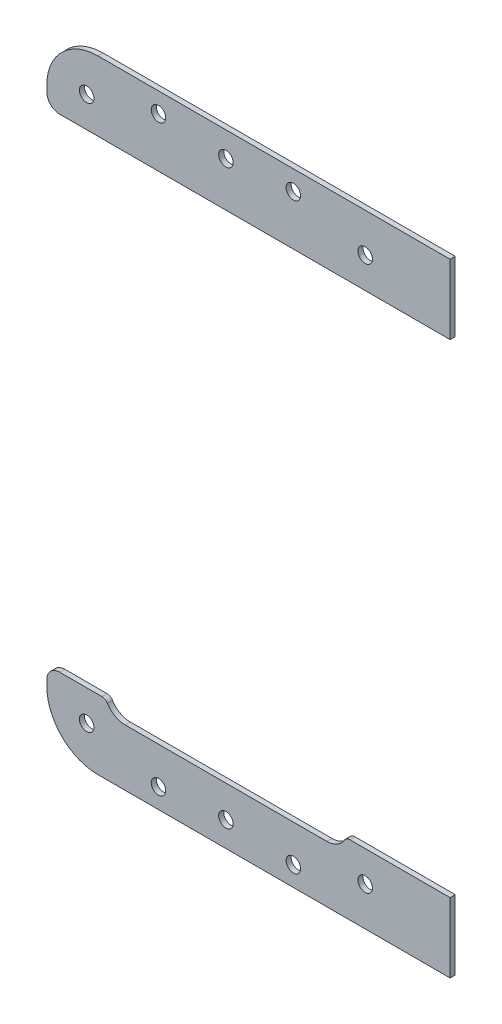
ISO-10303-21;
HEADER;
FILE_DESCRIPTION(('STEP AP214'),'2;1');
FILE_NAME('part.step','',(''),(''),'','','');
FILE_SCHEMA(('AUTOMOTIVE_DESIGN { 1 0 10303 214 1 1 1 1 }'));
ENDSEC;
DATA;
#1=APPLICATION_CONTEXT('core data for automotive mechanical design processes');
#2=APPLICATION_PROTOCOL_DEFINITION('international standard','automotive_design',2000,#1);
#3=PRODUCT_CONTEXT('',#1,'mechanical');
#4=PRODUCT('Part','Part','',(#3));
#5=PRODUCT_RELATED_PRODUCT_CATEGORY('part','',(#4));
#6=PRODUCT_DEFINITION_FORMATION('','',#4);
#7=PRODUCT_DEFINITION_CONTEXT('part definition',#1,'design');
#8=PRODUCT_DEFINITION('design','',#6,#7);
#9=PRODUCT_DEFINITION_SHAPE('','',#8);
#10=(LENGTH_UNIT() NAMED_UNIT(*) SI_UNIT(.MILLI.,.METRE.));
#11=(NAMED_UNIT(*) PLANE_ANGLE_UNIT() SI_UNIT($,.RADIAN.));
#12=(NAMED_UNIT(*) SI_UNIT($,.STERADIAN.) SOLID_ANGLE_UNIT());
#13=UNCERTAINTY_MEASURE_WITH_UNIT(LENGTH_MEASURE(1.E-05),#10,'distance_accuracy_value','');
#14=(GEOMETRIC_REPRESENTATION_CONTEXT(3) GLOBAL_UNCERTAINTY_ASSIGNED_CONTEXT((#13)) GLOBAL_UNIT_ASSIGNED_CONTEXT((#10,
#11,#12)) REPRESENTATION_CONTEXT('',''));
#15=CARTESIAN_POINT('',(0.,0.,0.));
#16=DIRECTION('',(0.,0.,1.));
#17=DIRECTION('',(1.,0.,0.));
#18=AXIS2_PLACEMENT_3D('',#15,#16,#17);
#19=CARTESIAN_POINT('',(0.,0.,-399.91660466235));
#20=DIRECTION('',(0.,0.,1.));
#21=DIRECTION('',(1.,0.,0.));
#22=AXIS2_PLACEMENT_3D('',#19,#20,#21);
#23=PLANE('',#22);
#24=CARTESIAN_POINT('',(-27.5617458625987,195.670051609485,-399.91660466235));
#25=DIRECTION('',(0.,0.,1.));
#26=DIRECTION('',(-1.,0.,0.));
#27=AXIS2_PLACEMENT_3D('',#24,#25,#26);
#28=CIRCLE('',#27,2.24999999999999);
#29=CARTESIAN_POINT('',(-29.8117458625987,195.670051609485,-399.91660466235));
#30=VERTEX_POINT('',#29);
#31=EDGE_CURVE('E174',#30,#30,#28,.T.);
#32=ORIENTED_EDGE('',*,*,#31,.F.);
#33=EDGE_LOOP('',(#32));
#34=FACE_BOUND('',#33,.T.);
#35=CARTESIAN_POINT('',(36.5405370906553,189.761421859265,-399.91660466235));
#36=DIRECTION('',(0.,0.,1.));
#37=DIRECTION('',(1.,0.,0.));
#38=AXIS2_PLACEMENT_3D('',#35,#36,#37);
#39=CIRCLE('',#38,2.24999999999999);
#40=CARTESIAN_POINT('',(38.7905370906553,189.761421859265,-399.91660466235));
#41=VERTEX_POINT('',#40);
#42=EDGE_CURVE('E170',#41,#41,#39,.T.);
#43=ORIENTED_EDGE('',*,*,#42,.F.);
#44=EDGE_LOOP('',(#43));
#45=FACE_BOUND('',#44,.T.);
#46=CARTESIAN_POINT('',(-6.65083315912471,194.079751609485,-399.91660466235));
#47=DIRECTION('',(0.,0.,1.));
#48=DIRECTION('',(1.,0.,0.));
#49=AXIS2_PLACEMENT_3D('',#46,#47,#48);
#50=CIRCLE('',#49,2.24999999999999);
#51=CARTESIAN_POINT('',(-4.40083315912472,194.079751609485,-399.91660466235));
#52=VERTEX_POINT('',#51);
#53=EDGE_CURVE('E164',#52,#52,#50,.T.);
#54=ORIENTED_EDGE('',*,*,#53,.F.);
#55=EDGE_LOOP('',(#54));
#56=FACE_BOUND('',#55,.T.);
#57=CARTESIAN_POINT('',(-49.8422034089048,189.761421859265,-399.91660466235));
#58=DIRECTION('',(0.,0.,1.));
#59=DIRECTION('',(1.,0.,0.));
#60=AXIS2_PLACEMENT_3D('',#57,#58,#59);
#61=CIRCLE('',#60,2.24999999999999);
#62=CARTESIAN_POINT('',(-47.5922034089049,189.761421859265,-399.91660466235));
#63=VERTEX_POINT('',#62);
#64=EDGE_CURVE('E158',#63,#63,#61,.T.);
#65=ORIENTED_EDGE('',*,*,#64,.F.);
#66=EDGE_LOOP('',(#65));
#67=FACE_BOUND('',#66,.T.);
#68=CARTESIAN_POINT('',(14.2600795443493,195.670051609485,-399.91660466235));
#69=DIRECTION('',(0.,0.,1.));
#70=DIRECTION('',(1.,0.,0.));
#71=AXIS2_PLACEMENT_3D('',#68,#69,#70);
#72=CIRCLE('',#71,2.24999999999999);
#73=CARTESIAN_POINT('',(16.5100795443493,195.670051609485,-399.91660466235));
#74=VERTEX_POINT('',#73);
#75=EDGE_CURVE('E152',#74,#74,#72,.T.);
#76=ORIENTED_EDGE('',*,*,#75,.F.);
#77=EDGE_LOOP('',(#76));
#78=FACE_BOUND('',#77,.T.);
#79=DIRECTION('',(0.,1.,0.));
#80=VECTOR('',#79,1.);
#81=CARTESIAN_POINT('',(-62.2133331591248,0.,-399.91660466235));
#82=LINE('',#81,#80);
#83=CARTESIAN_POINT('',(-62.2133331591248,184.225051609485,-399.91660466235));
#84=VERTEX_POINT('',#83);
#85=CARTESIAN_POINT('',(-62.2133331591248,185.940051609485,-399.91660466235));
#86=VERTEX_POINT('',#85);
#87=EDGE_CURVE('E122',#84,#86,#82,.T.);
#88=ORIENTED_EDGE('',*,*,#87,.F.);
#89=CARTESIAN_POINT('',(-58.2133331591248,184.225051609485,-399.91660466235));
#90=DIRECTION('',(0.,0.,1.));
#91=DIRECTION('',(1.,0.,0.));
#92=AXIS2_PLACEMENT_3D('',#89,#90,#91);
#93=CIRCLE('',#92,4.);
#94=CARTESIAN_POINT('',(-58.2133331591248,180.225051609485,-399.91660466235));
#95=VERTEX_POINT('',#94);
#96=EDGE_CURVE('E66',#84,#95,#93,.T.);
#97=ORIENTED_EDGE('',*,*,#96,.T.);
#98=DIRECTION('',(-1.,0.,0.));
#99=VECTOR('',#98,1.);
#100=CARTESIAN_POINT('',(-62.2133331591248,180.225051609485,-399.91660466235));
#101=LINE('',#100,#99);
#102=CARTESIAN_POINT('',(62.8816668408752,180.225051609485,-399.91660466235));
#103=VERTEX_POINT('',#102);
#104=EDGE_CURVE('E110',#103,#95,#101,.T.);
#105=ORIENTED_EDGE('',*,*,#104,.F.);
#106=DIRECTION('',(0.,1.,0.));
#107=VECTOR('',#106,1.);
#108=CARTESIAN_POINT('',(62.8816668408752,201.815051609485,-399.91660466235));
#109=LINE('',#108,#107);
#110=CARTESIAN_POINT('',(62.8816668408752,201.815051609485,-399.91660466235));
#111=VERTEX_POINT('',#110);
#112=EDGE_CURVE('E109',#103,#111,#109,.T.);
#113=ORIENTED_EDGE('',*,*,#112,.T.);
#114=DIRECTION('',(-1.,0.,0.));
#115=VECTOR('',#114,1.);
#116=CARTESIAN_POINT('',(0.,201.815051609485,-399.91660466235));
#117=LINE('',#116,#115);
#118=CARTESIAN_POINT('',(-46.3383331591248,201.815051609485,-399.91660466235));
#119=VERTEX_POINT('',#118);
#120=EDGE_CURVE('E128',#111,#119,#117,.T.);
#121=ORIENTED_EDGE('',*,*,#120,.T.);
#122=CARTESIAN_POINT('',(-46.3383331591248,185.940051609485,-399.91660466235));
#123=DIRECTION('',(0.,0.,1.));
#124=DIRECTION('',(1.,0.,0.));
#125=AXIS2_PLACEMENT_3D('',#122,#123,#124);
#126=CIRCLE('',#125,15.875);
#127=EDGE_CURVE('E101',#119,#86,#126,.T.);
#128=ORIENTED_EDGE('',*,*,#127,.T.);
#129=EDGE_LOOP('',(#88,#97,#105,#113,#121,#128));
#130=FACE_BOUND('',#129,.T.);
#131=ADVANCED_FACE('F44',(#34,#45,#56,#67,#78,#130),#23,.T.);
#132=CARTESIAN_POINT('',(0.,0.,-401.50410466235));
#133=DIRECTION('',(0.,0.,1.));
#134=DIRECTION('',(1.,0.,0.));
#135=AXIS2_PLACEMENT_3D('',#132,#133,#134);
#136=PLANE('',#135);
#137=CARTESIAN_POINT('',(-27.5617458625987,195.670051609485,-401.50410466235));
#138=DIRECTION('',(0.,0.,1.));
#139=DIRECTION('',(-1.,0.,0.));
#140=AXIS2_PLACEMENT_3D('',#137,#138,#139);
#141=CIRCLE('',#140,2.24999999999999);
#142=CARTESIAN_POINT('',(-29.8117458625987,195.670051609485,-401.50410466235));
#143=VERTEX_POINT('',#142);
#144=EDGE_CURVE('E173',#143,#143,#141,.T.);
#145=ORIENTED_EDGE('',*,*,#144,.T.);
#146=EDGE_LOOP('',(#145));
#147=FACE_BOUND('',#146,.T.);
#148=CARTESIAN_POINT('',(36.5405370906553,189.761421859265,-401.50410466235));
#149=DIRECTION('',(0.,0.,1.));
#150=DIRECTION('',(1.,0.,0.));
#151=AXIS2_PLACEMENT_3D('',#148,#149,#150);
#152=CIRCLE('',#151,2.25);
#153=CARTESIAN_POINT('',(38.7905370906553,189.761421859265,-401.50410466235));
#154=VERTEX_POINT('',#153);
#155=EDGE_CURVE('E167',#154,#154,#152,.T.);
#156=ORIENTED_EDGE('',*,*,#155,.T.);
#157=EDGE_LOOP('',(#156));
#158=FACE_BOUND('',#157,.T.);
#159=CARTESIAN_POINT('',(-6.65083315912471,194.079751609485,-401.50410466235));
#160=DIRECTION('',(0.,0.,1.));
#161=DIRECTION('',(1.,0.,0.));
#162=AXIS2_PLACEMENT_3D('',#159,#160,#161);
#163=CIRCLE('',#162,2.25);
#164=CARTESIAN_POINT('',(-4.40083315912471,194.079751609485,-401.50410466235));
#165=VERTEX_POINT('',#164);
#166=EDGE_CURVE('E161',#165,#165,#163,.T.);
#167=ORIENTED_EDGE('',*,*,#166,.T.);
#168=EDGE_LOOP('',(#167));
#169=FACE_BOUND('',#168,.T.);
#170=CARTESIAN_POINT('',(-49.8422034089048,189.761421859265,-401.50410466235));
#171=DIRECTION('',(0.,0.,1.));
#172=DIRECTION('',(1.,0.,0.));
#173=AXIS2_PLACEMENT_3D('',#170,#171,#172);
#174=CIRCLE('',#173,2.25);
#175=CARTESIAN_POINT('',(-47.5922034089048,189.761421859265,-401.50410466235));
#176=VERTEX_POINT('',#175);
#177=EDGE_CURVE('E155',#176,#176,#174,.T.);
#178=ORIENTED_EDGE('',*,*,#177,.T.);
#179=EDGE_LOOP('',(#178));
#180=FACE_BOUND('',#179,.T.);
#181=CARTESIAN_POINT('',(14.2600795443493,195.670051609485,-401.50410466235));
#182=DIRECTION('',(0.,0.,1.));
#183=DIRECTION('',(1.,0.,0.));
#184=AXIS2_PLACEMENT_3D('',#181,#182,#183);
#185=CIRCLE('',#184,2.25);
#186=CARTESIAN_POINT('',(16.5100795443493,195.670051609485,-401.50410466235));
#187=VERTEX_POINT('',#186);
#188=EDGE_CURVE('E129',#187,#187,#185,.T.);
#189=ORIENTED_EDGE('',*,*,#188,.T.);
#190=EDGE_LOOP('',(#189));
#191=FACE_BOUND('',#190,.T.);
#192=DIRECTION('',(-1.,0.,0.));
#193=VECTOR('',#192,1.);
#194=CARTESIAN_POINT('',(0.,180.225051609485,-401.50410466235));
#195=LINE('',#194,#193);
#196=CARTESIAN_POINT('',(62.8816668408752,180.225051609485,-401.50410466235));
#197=VERTEX_POINT('',#196);
#198=CARTESIAN_POINT('',(-58.2133331591248,180.225051609485,-401.50410466235));
#199=VERTEX_POINT('',#198);
#200=EDGE_CURVE('E93',#197,#199,#195,.T.);
#201=ORIENTED_EDGE('',*,*,#200,.T.);
#202=CARTESIAN_POINT('',(-58.2133331591248,184.225051609485,-401.50410466235));
#203=DIRECTION('',(0.,0.,1.));
#204=DIRECTION('',(1.,0.,0.));
#205=AXIS2_PLACEMENT_3D('',#202,#203,#204);
#206=CIRCLE('',#205,4.);
#207=CARTESIAN_POINT('',(-62.2133331591248,184.225051609485,-401.50410466235));
#208=VERTEX_POINT('',#207);
#209=EDGE_CURVE('E12',#199,#208,#206,.F.);
#210=ORIENTED_EDGE('',*,*,#209,.T.);
#211=DIRECTION('',(0.,1.,0.));
#212=VECTOR('',#211,1.);
#213=CARTESIAN_POINT('',(-62.2133331591248,0.,-401.50410466235));
#214=LINE('',#213,#212);
#215=CARTESIAN_POINT('',(-62.2133331591248,185.940051609485,-401.50410466235));
#216=VERTEX_POINT('',#215);
#217=EDGE_CURVE('E100',#208,#216,#214,.T.);
#218=ORIENTED_EDGE('',*,*,#217,.T.);
#219=CARTESIAN_POINT('',(-46.3383331591248,185.940051609485,-401.50410466235));
#220=DIRECTION('',(0.,0.,1.));
#221=DIRECTION('',(1.,0.,0.));
#222=AXIS2_PLACEMENT_3D('',#219,#220,#221);
#223=CIRCLE('',#222,15.875);
#224=CARTESIAN_POINT('',(-46.3383331591248,201.815051609485,-401.50410466235));
#225=VERTEX_POINT('',#224);
#226=EDGE_CURVE('E137',#216,#225,#223,.F.);
#227=ORIENTED_EDGE('',*,*,#226,.T.);
#228=DIRECTION('',(-1.,0.,0.));
#229=VECTOR('',#228,1.);
#230=CARTESIAN_POINT('',(0.,201.815051609485,-401.50410466235));
#231=LINE('',#230,#229);
#232=CARTESIAN_POINT('',(62.8816668408752,201.815051609485,-401.50410466235));
#233=VERTEX_POINT('',#232);
#234=EDGE_CURVE('E115',#233,#225,#231,.T.);
#235=ORIENTED_EDGE('',*,*,#234,.F.);
#236=DIRECTION('',(0.,1.,0.));
#237=VECTOR('',#236,1.);
#238=CARTESIAN_POINT('',(62.8816668408752,201.815051609485,-401.50410466235));
#239=LINE('',#238,#237);
#240=EDGE_CURVE('E107',#197,#233,#239,.T.);
#241=ORIENTED_EDGE('',*,*,#240,.F.);
#242=EDGE_LOOP('',(#201,#210,#218,#227,#235,#241));
#243=FACE_BOUND('',#242,.T.);
#244=ADVANCED_FACE('F113',(#147,#158,#169,#180,#191,#243),#136,.F.);
#245=CARTESIAN_POINT('',(-62.2133331591248,0.,-399.91660466235));
#246=DIRECTION('',(-1.,0.,0.));
#247=DIRECTION('',(0.,0.,1.));
#248=AXIS2_PLACEMENT_3D('',#245,#246,#247);
#249=PLANE('',#248);
#250=ORIENTED_EDGE('',*,*,#217,.F.);
#251=DIRECTION('',(0.,0.,1.));
#252=VECTOR('',#251,1.);
#253=CARTESIAN_POINT('',(-62.2133331591248,184.225051609485,-399.91660466235));
#254=LINE('',#253,#252);
#255=EDGE_CURVE('E130',#208,#84,#254,.T.);
#256=ORIENTED_EDGE('',*,*,#255,.T.);
#257=ORIENTED_EDGE('',*,*,#87,.T.);
#258=DIRECTION('',(0.,0.,-1.));
#259=VECTOR('',#258,1.);
#260=CARTESIAN_POINT('',(-62.2133331591248,185.940051609485,-401.50410466235));
#261=LINE('',#260,#259);
#262=EDGE_CURVE('E118',#86,#216,#261,.T.);
#263=ORIENTED_EDGE('',*,*,#262,.T.);
#264=EDGE_LOOP('',(#250,#256,#257,#263));
#265=FACE_BOUND('',#264,.T.);
#266=ADVANCED_FACE('F227',(#265),#249,.T.);
#267=CARTESIAN_POINT('',(62.8816668408752,201.815051609485,-401.50410466235));
#268=DIRECTION('',(1.,0.,0.));
#269=DIRECTION('',(0.,1.,0.));
#270=AXIS2_PLACEMENT_3D('',#267,#268,#269);
#271=PLANE('',#270);
#272=DIRECTION('',(0.,0.,1.));
#273=VECTOR('',#272,1.);
#274=CARTESIAN_POINT('',(62.8816668408752,180.225051609485,-401.50410466235));
#275=LINE('',#274,#273);
#276=EDGE_CURVE('E96',#197,#103,#275,.T.);
#277=ORIENTED_EDGE('',*,*,#276,.F.);
#278=ORIENTED_EDGE('',*,*,#240,.T.);
#279=DIRECTION('',(0.,0.,1.));
#280=VECTOR('',#279,1.);
#281=CARTESIAN_POINT('',(62.8816668408752,201.815051609485,-401.50410466235));
#282=LINE('',#281,#280);
#283=EDGE_CURVE('E117',#233,#111,#282,.T.);
#284=ORIENTED_EDGE('',*,*,#283,.T.);
#285=ORIENTED_EDGE('',*,*,#112,.F.);
#286=EDGE_LOOP('',(#277,#278,#284,#285));
#287=FACE_BOUND('',#286,.T.);
#288=ADVANCED_FACE('F105',(#287),#271,.T.);
#289=CARTESIAN_POINT('',(0.,201.815051609485,-399.91660466235));
#290=DIRECTION('',(0.,-1.,0.));
#291=DIRECTION('',(0.,0.,-1.));
#292=AXIS2_PLACEMENT_3D('',#289,#290,#291);
#293=PLANE('',#292);
#294=ORIENTED_EDGE('',*,*,#234,.T.);
#295=DIRECTION('',(0.,0.,-1.));
#296=VECTOR('',#295,1.);
#297=CARTESIAN_POINT('',(-46.3383331591248,201.815051609485,-399.91660466235));
#298=LINE('',#297,#296);
#299=EDGE_CURVE('E111',#225,#119,#298,.F.);
#300=ORIENTED_EDGE('',*,*,#299,.T.);
#301=ORIENTED_EDGE('',*,*,#120,.F.);
#302=ORIENTED_EDGE('',*,*,#283,.F.);
#303=EDGE_LOOP('',(#294,#300,#301,#302));
#304=FACE_BOUND('',#303,.T.);
#305=ADVANCED_FACE('F218',(#304),#293,.F.);
#306=CARTESIAN_POINT('',(-46.3383331591248,185.940051609485,-399.91660466235));
#307=DIRECTION('',(0.,0.,1.));
#308=DIRECTION('',(1.,0.,0.));
#309=AXIS2_PLACEMENT_3D('',#306,#307,#308);
#310=CYLINDRICAL_SURFACE('',#309,15.875);
#311=ORIENTED_EDGE('',*,*,#127,.F.);
#312=ORIENTED_EDGE('',*,*,#299,.F.);
#313=ORIENTED_EDGE('',*,*,#226,.F.);
#314=ORIENTED_EDGE('',*,*,#262,.F.);
#315=EDGE_LOOP('',(#311,#312,#313,#314));
#316=FACE_BOUND('',#315,.T.);
#317=ADVANCED_FACE('F215',(#316),#310,.T.);
#318=CARTESIAN_POINT('',(-62.2133331591248,180.225051609485,-479.91660466235));
#319=DIRECTION('',(0.,1.,0.));
#320=DIRECTION('',(0.,0.,1.));
#321=AXIS2_PLACEMENT_3D('',#318,#319,#320);
#322=PLANE('',#321);
#323=ORIENTED_EDGE('',*,*,#104,.T.);
#324=DIRECTION('',(0.,0.,1.));
#325=VECTOR('',#324,1.);
#326=CARTESIAN_POINT('',(-58.2133331591248,180.225051609485,-401.50410466235));
#327=LINE('',#326,#325);
#328=EDGE_CURVE('E52',#95,#199,#327,.F.);
#329=ORIENTED_EDGE('',*,*,#328,.T.);
#330=ORIENTED_EDGE('',*,*,#200,.F.);
#331=ORIENTED_EDGE('',*,*,#276,.T.);
#332=EDGE_LOOP('',(#323,#329,#330,#331));
#333=FACE_BOUND('',#332,.T.);
#334=ADVANCED_FACE('F95',(#333),#322,.F.);
#335=CARTESIAN_POINT('',(-58.2133331591248,184.225051609485,-399.91660466235));
#336=DIRECTION('',(0.,0.,-1.));
#337=DIRECTION('',(-1.,0.,0.));
#338=AXIS2_PLACEMENT_3D('',#335,#336,#337);
#339=CYLINDRICAL_SURFACE('',#338,4.);
#340=ORIENTED_EDGE('',*,*,#209,.F.);
#341=ORIENTED_EDGE('',*,*,#328,.F.);
#342=ORIENTED_EDGE('',*,*,#96,.F.);
#343=ORIENTED_EDGE('',*,*,#255,.F.);
#344=EDGE_LOOP('',(#340,#341,#342,#343));
#345=FACE_BOUND('',#344,.T.);
#346=ADVANCED_FACE('F46',(#345),#339,.T.);
#347=CARTESIAN_POINT('',(14.2600795443493,195.670051609485,-399.91660466235));
#348=DIRECTION('',(0.,0.,1.));
#349=DIRECTION('',(1.,0.,0.));
#350=AXIS2_PLACEMENT_3D('',#347,#348,#349);
#351=CYLINDRICAL_SURFACE('',#350,2.25);
#352=ORIENTED_EDGE('',*,*,#188,.F.);
#353=EDGE_LOOP('',(#352));
#354=FACE_BOUND('',#353,.T.);
#355=ORIENTED_EDGE('',*,*,#75,.T.);
#356=EDGE_LOOP('',(#355));
#357=FACE_BOUND('',#356,.T.);
#358=ADVANCED_FACE('F199',(#354,#357),#351,.F.);
#359=CARTESIAN_POINT('',(-49.8422034089048,189.761421859265,-399.91660466235));
#360=DIRECTION('',(0.,0.,1.));
#361=DIRECTION('',(1.,0.,0.));
#362=AXIS2_PLACEMENT_3D('',#359,#360,#361);
#363=CYLINDRICAL_SURFACE('',#362,2.25);
#364=ORIENTED_EDGE('',*,*,#177,.F.);
#365=EDGE_LOOP('',(#364));
#366=FACE_BOUND('',#365,.T.);
#367=ORIENTED_EDGE('',*,*,#64,.T.);
#368=EDGE_LOOP('',(#367));
#369=FACE_BOUND('',#368,.T.);
#370=ADVANCED_FACE('F201',(#366,#369),#363,.F.);
#371=CARTESIAN_POINT('',(-6.65083315912471,194.079751609485,-399.91660466235));
#372=DIRECTION('',(0.,0.,1.));
#373=DIRECTION('',(1.,0.,0.));
#374=AXIS2_PLACEMENT_3D('',#371,#372,#373);
#375=CYLINDRICAL_SURFACE('',#374,2.24999999999999);
#376=ORIENTED_EDGE('',*,*,#166,.F.);
#377=EDGE_LOOP('',(#376));
#378=FACE_BOUND('',#377,.T.);
#379=ORIENTED_EDGE('',*,*,#53,.T.);
#380=EDGE_LOOP('',(#379));
#381=FACE_BOUND('',#380,.T.);
#382=ADVANCED_FACE('F208',(#378,#381),#375,.F.);
#383=CARTESIAN_POINT('',(36.5405370906553,189.761421859265,-399.91660466235));
#384=DIRECTION('',(0.,0.,1.));
#385=DIRECTION('',(1.,0.,0.));
#386=AXIS2_PLACEMENT_3D('',#383,#384,#385);
#387=CYLINDRICAL_SURFACE('',#386,2.25);
#388=ORIENTED_EDGE('',*,*,#155,.F.);
#389=EDGE_LOOP('',(#388));
#390=FACE_BOUND('',#389,.T.);
#391=ORIENTED_EDGE('',*,*,#42,.T.);
#392=EDGE_LOOP('',(#391));
#393=FACE_BOUND('',#392,.T.);
#394=ADVANCED_FACE('F185',(#390,#393),#387,.F.);
#395=CARTESIAN_POINT('',(-27.5617458625987,195.670051609485,-401.50410466235));
#396=DIRECTION('',(0.,0.,1.));
#397=DIRECTION('',(1.,0.,0.));
#398=AXIS2_PLACEMENT_3D('',#395,#396,#397);
#399=CYLINDRICAL_SURFACE('',#398,2.24999999999999);
#400=ORIENTED_EDGE('',*,*,#144,.F.);
#401=EDGE_LOOP('',(#400));
#402=FACE_BOUND('',#401,.T.);
#403=ORIENTED_EDGE('',*,*,#31,.T.);
#404=EDGE_LOOP('',(#403));
#405=FACE_BOUND('',#404,.T.);
#406=ADVANCED_FACE('F182',(#402,#405),#399,.F.);
#407=CLOSED_SHELL('',(#131,#244,#266,#288,#305,#317,#334,#346,#358,#370,#382,#394,#406));
#408=MANIFOLD_SOLID_BREP('B2',#407);
#409=CARTESIAN_POINT('',(-46.3383331591248,24.6500516094852,-399.91660466235));
#410=DIRECTION('',(0.,0.,-1.));
#411=DIRECTION('',(-1.,0.,0.));
#412=AXIS2_PLACEMENT_3D('',#409,#410,#411);
#413=CYLINDRICAL_SURFACE('',#412,15.875);
#414=CARTESIAN_POINT('',(-46.3383331591248,24.6500516094852,-399.91660466235));
#415=DIRECTION('',(0.,0.,1.));
#416=DIRECTION('',(1.,0.,0.));
#417=AXIS2_PLACEMENT_3D('',#414,#415,#416);
#418=CIRCLE('',#417,15.875);
#419=CARTESIAN_POINT('',(-62.2133331591248,24.6500516094852,-399.91660466235));
#420=VERTEX_POINT('',#419);
#421=CARTESIAN_POINT('',(-46.3383331591248,8.77505160948517,-399.91660466235));
#422=VERTEX_POINT('',#421);
#423=EDGE_CURVE('E467',#420,#422,#418,.T.);
#424=ORIENTED_EDGE('',*,*,#423,.F.);
#425=DIRECTION('',(0.,0.,-1.));
#426=VECTOR('',#425,1.);
#427=CARTESIAN_POINT('',(-62.2133331591248,24.6500516094852,-399.91660466235));
#428=LINE('',#427,#426);
#429=CARTESIAN_POINT('',(-62.2133331591248,24.6500516094852,-401.50410466235));
#430=VERTEX_POINT('',#429);
#431=EDGE_CURVE('E459',#430,#420,#428,.F.);
#432=ORIENTED_EDGE('',*,*,#431,.F.);
#433=CARTESIAN_POINT('',(-46.3383331591248,24.6500516094852,-401.50410466235));
#434=DIRECTION('',(0.,0.,1.));
#435=DIRECTION('',(1.,0.,0.));
#436=AXIS2_PLACEMENT_3D('',#433,#434,#435);
#437=CIRCLE('',#436,15.875);
#438=CARTESIAN_POINT('',(-46.3383331591248,8.77505160948517,-401.50410466235));
#439=VERTEX_POINT('',#438);
#440=EDGE_CURVE('E465',#439,#430,#437,.F.);
#441=ORIENTED_EDGE('',*,*,#440,.F.);
#442=DIRECTION('',(0.,0.,-1.));
#443=VECTOR('',#442,1.);
#444=CARTESIAN_POINT('',(-46.3383331591248,8.77505160948517,-399.91660466235));
#445=LINE('',#444,#443);
#446=EDGE_CURVE('E469',#422,#439,#445,.T.);
#447=ORIENTED_EDGE('',*,*,#446,.F.);
#448=EDGE_LOOP('',(#424,#432,#441,#447));
#449=FACE_BOUND('',#448,.T.);
#450=ADVANCED_FACE('F334',(#449),#413,.T.);
#451=CARTESIAN_POINT('',(0.,8.77505160948518,-399.91660466235));
#452=DIRECTION('',(0.,-1.,0.));
#453=DIRECTION('',(1.,0.,0.));
#454=AXIS2_PLACEMENT_3D('',#451,#452,#453);
#455=PLANE('',#454);
#456=DIRECTION('',(-1.,0.,0.));
#457=VECTOR('',#456,1.);
#458=CARTESIAN_POINT('',(0.,8.77505160948518,-399.91660466235));
#459=LINE('',#458,#457);
#460=CARTESIAN_POINT('',(62.8816668408752,8.77505160948519,-399.91660466235));
#461=VERTEX_POINT('',#460);
#462=EDGE_CURVE('E441',#461,#422,#459,.T.);
#463=ORIENTED_EDGE('',*,*,#462,.T.);
#464=ORIENTED_EDGE('',*,*,#446,.T.);
#465=DIRECTION('',(-1.,0.,0.));
#466=VECTOR('',#465,1.);
#467=CARTESIAN_POINT('',(0.,8.77505160948518,-401.50410466235));
#468=LINE('',#467,#466);
#469=CARTESIAN_POINT('',(62.8816668408752,8.77505160948519,-401.50410466235));
#470=VERTEX_POINT('',#469);
#471=EDGE_CURVE('E457',#470,#439,#468,.T.);
#472=ORIENTED_EDGE('',*,*,#471,.F.);
#473=DIRECTION('',(0.,0.,1.));
#474=VECTOR('',#473,1.);
#475=CARTESIAN_POINT('',(62.8816668408752,8.77505160948519,-401.50410466235));
#476=LINE('',#475,#474);
#477=EDGE_CURVE('E445',#470,#461,#476,.T.);
#478=ORIENTED_EDGE('',*,*,#477,.T.);
#479=EDGE_LOOP('',(#463,#464,#472,#478));
#480=FACE_BOUND('',#479,.T.);
#481=ADVANCED_FACE('F597',(#480),#455,.T.);
#482=CARTESIAN_POINT('',(0.,26.3578321245151,-401.50410466235));
#483=DIRECTION('',(0.,1.,0.));
#484=DIRECTION('',(-1.,0.,0.));
#485=AXIS2_PLACEMENT_3D('',#482,#483,#484);
#486=PLANE('',#485);
#487=DIRECTION('',(-1.,0.,0.));
#488=VECTOR('',#487,1.);
#489=CARTESIAN_POINT('',(0.,26.3578321245151,-401.50410466235));
#490=LINE('',#489,#488);
#491=CARTESIAN_POINT('',(24.6613863258453,26.3578321245151,-401.50410466235));
#492=VERTEX_POINT('',#491);
#493=CARTESIAN_POINT('',(-37.9630526440947,26.3578321245151,-401.50410466235));
#494=VERTEX_POINT('',#493);
#495=EDGE_CURVE('E443',#492,#494,#490,.T.);
#496=ORIENTED_EDGE('',*,*,#495,.T.);
#497=DIRECTION('',(0.,0.,1.));
#498=VECTOR('',#497,1.);
#499=CARTESIAN_POINT('',(-37.9630526440947,26.3578321245151,-399.91660466235));
#500=LINE('',#499,#498);
#501=CARTESIAN_POINT('',(-37.9630526440947,26.3578321245151,-399.91660466235));
#502=VERTEX_POINT('',#501);
#503=EDGE_CURVE('E474',#494,#502,#500,.T.);
#504=ORIENTED_EDGE('',*,*,#503,.T.);
#505=DIRECTION('',(-1.,0.,0.));
#506=VECTOR('',#505,1.);
#507=CARTESIAN_POINT('',(0.,26.3578321245151,-399.91660466235));
#508=LINE('',#507,#506);
#509=CARTESIAN_POINT('',(24.6613863258453,26.3578321245151,-399.91660466235));
#510=VERTEX_POINT('',#509);
#511=EDGE_CURVE('E448',#510,#502,#508,.T.);
#512=ORIENTED_EDGE('',*,*,#511,.F.);
#513=DIRECTION('',(0.,0.,1.));
#514=VECTOR('',#513,1.);
#515=CARTESIAN_POINT('',(24.6613863258453,26.3578321245151,-401.50410466235));
#516=LINE('',#515,#514);
#517=EDGE_CURVE('E472',#510,#492,#516,.F.);
#518=ORIENTED_EDGE('',*,*,#517,.T.);
#519=EDGE_LOOP('',(#496,#504,#512,#518));
#520=FACE_BOUND('',#519,.T.);
#521=ADVANCED_FACE('F519',(#520),#486,.T.);
#522=CARTESIAN_POINT('',(62.8816668408752,201.815051609485,-401.50410466235));
#523=DIRECTION('',(1.,0.,0.));
#524=DIRECTION('',(0.,1.,0.));
#525=AXIS2_PLACEMENT_3D('',#522,#523,#524);
#526=PLANE('',#525);
#527=DIRECTION('',(0.,0.,1.));
#528=VECTOR('',#527,1.);
#529=CARTESIAN_POINT('',(62.8816668408752,30.3650516094852,-479.91660466235));
#530=LINE('',#529,#528);
#531=CARTESIAN_POINT('',(62.8816668408752,30.3650516094852,-401.50410466235));
#532=VERTEX_POINT('',#531);
#533=CARTESIAN_POINT('',(62.8816668408752,30.3650516094852,-399.91660466235));
#534=VERTEX_POINT('',#533);
#535=EDGE_CURVE('E422',#532,#534,#530,.T.);
#536=ORIENTED_EDGE('',*,*,#535,.T.);
#537=DIRECTION('',(0.,1.,0.));
#538=VECTOR('',#537,1.);
#539=CARTESIAN_POINT('',(62.8816668408752,201.815051609485,-399.91660466235));
#540=LINE('',#539,#538);
#541=EDGE_CURVE('E434',#461,#534,#540,.T.);
#542=ORIENTED_EDGE('',*,*,#541,.F.);
#543=ORIENTED_EDGE('',*,*,#477,.F.);
#544=DIRECTION('',(0.,1.,0.));
#545=VECTOR('',#544,1.);
#546=CARTESIAN_POINT('',(62.8816668408752,201.815051609485,-401.50410466235));
#547=LINE('',#546,#545);
#548=EDGE_CURVE('E436',#470,#532,#547,.T.);
#549=ORIENTED_EDGE('',*,*,#548,.T.);
#550=EDGE_LOOP('',(#536,#542,#543,#549));
#551=FACE_BOUND('',#550,.T.);
#552=ADVANCED_FACE('F432',(#551),#526,.T.);
#553=CARTESIAN_POINT('',(24.6613863258453,32.7078321245151,-401.50410466235));
#554=DIRECTION('',(0.,0.,1.));
#555=DIRECTION('',(1.,0.,0.));
#556=AXIS2_PLACEMENT_3D('',#553,#554,#555);
#557=CYLINDRICAL_SURFACE('',#556,6.35);
#558=CARTESIAN_POINT('',(24.6613863258453,32.7078321245151,-399.91660466235));
#559=DIRECTION('',(0.,0.,1.));
#560=DIRECTION('',(1.,0.,0.));
#561=AXIS2_PLACEMENT_3D('',#558,#559,#560);
#562=CIRCLE('',#561,6.35);
#563=CARTESIAN_POINT('',(30.0849806822009,29.405238559193,-399.91660466235));
#564=VERTEX_POINT('',#563);
#565=EDGE_CURVE('E482',#564,#510,#562,.F.);
#566=ORIENTED_EDGE('',*,*,#565,.F.);
#567=DIRECTION('',(0.,0.,1.));
#568=VECTOR('',#567,1.);
#569=CARTESIAN_POINT('',(30.0849806822009,29.405238559193,-401.50410466235));
#570=LINE('',#569,#568);
#571=CARTESIAN_POINT('',(30.0849806822009,29.405238559193,-401.50410466235));
#572=VERTEX_POINT('',#571);
#573=EDGE_CURVE('E504',#564,#572,#570,.F.);
#574=ORIENTED_EDGE('',*,*,#573,.T.);
#575=CARTESIAN_POINT('',(24.6613863258453,32.7078321245151,-401.50410466235));
#576=DIRECTION('',(0.,0.,1.));
#577=DIRECTION('',(1.,0.,0.));
#578=AXIS2_PLACEMENT_3D('',#575,#576,#577);
#579=CIRCLE('',#578,6.35);
#580=EDGE_CURVE('E484',#492,#572,#579,.T.);
#581=ORIENTED_EDGE('',*,*,#580,.F.);
#582=ORIENTED_EDGE('',*,*,#517,.F.);
#583=EDGE_LOOP('',(#566,#574,#581,#582));
#584=FACE_BOUND('',#583,.T.);
#585=ADVANCED_FACE('F511',(#584),#557,.F.);
#586=CARTESIAN_POINT('',(-37.9630526440947,32.7078321245151,-401.50410466235));
#587=DIRECTION('',(0.,0.,-1.));
#588=DIRECTION('',(-1.,0.,0.));
#589=AXIS2_PLACEMENT_3D('',#586,#587,#588);
#590=CYLINDRICAL_SURFACE('',#589,6.35);
#591=CARTESIAN_POINT('',(-37.9630526440947,32.7078321245151,-401.50410466235));
#592=DIRECTION('',(0.,0.,1.));
#593=DIRECTION('',(1.,0.,0.));
#594=AXIS2_PLACEMENT_3D('',#591,#592,#593);
#595=CIRCLE('',#594,6.35);
#596=CARTESIAN_POINT('',(-43.3866470004503,29.405238559193,-401.50410466235));
#597=VERTEX_POINT('',#596);
#598=EDGE_CURVE('E480',#597,#494,#595,.T.);
#599=ORIENTED_EDGE('',*,*,#598,.F.);
#600=DIRECTION('',(0.,0.,-1.));
#601=VECTOR('',#600,1.);
#602=CARTESIAN_POINT('',(-43.3866470004503,29.405238559193,-401.50410466235));
#603=LINE('',#602,#601);
#604=CARTESIAN_POINT('',(-43.3866470004503,29.405238559193,-399.91660466235));
#605=VERTEX_POINT('',#604);
#606=EDGE_CURVE('E495',#597,#605,#603,.F.);
#607=ORIENTED_EDGE('',*,*,#606,.T.);
#608=CARTESIAN_POINT('',(-37.9630526440947,32.7078321245151,-399.91660466235));
#609=DIRECTION('',(0.,0.,1.));
#610=DIRECTION('',(1.,0.,0.));
#611=AXIS2_PLACEMENT_3D('',#608,#609,#610);
#612=CIRCLE('',#611,6.35);
#613=EDGE_CURVE('E477',#502,#605,#612,.F.);
#614=ORIENTED_EDGE('',*,*,#613,.F.);
#615=ORIENTED_EDGE('',*,*,#503,.F.);
#616=EDGE_LOOP('',(#599,#607,#614,#615));
#617=FACE_BOUND('',#616,.T.);
#618=ADVANCED_FACE('F523',(#617),#590,.F.);
#619=CARTESIAN_POINT('',(-62.2133331591248,0.,-399.91660466235));
#620=DIRECTION('',(-1.,0.,0.));
#621=DIRECTION('',(0.,0.,1.));
#622=AXIS2_PLACEMENT_3D('',#619,#620,#621);
#623=PLANE('',#622);
#624=DIRECTION('',(0.,1.,0.));
#625=VECTOR('',#624,1.);
#626=CARTESIAN_POINT('',(-62.2133331591248,0.,-399.91660466235));
#627=LINE('',#626,#625);
#628=CARTESIAN_POINT('',(-62.2133331591248,26.3650516094852,-399.91660466235));
#629=VERTEX_POINT('',#628);
#630=EDGE_CURVE('E454',#420,#629,#627,.T.);
#631=ORIENTED_EDGE('',*,*,#630,.T.);
#632=DIRECTION('',(0.,0.,1.));
#633=VECTOR('',#632,1.);
#634=CARTESIAN_POINT('',(-62.2133331591248,26.3650516094852,-401.50410466235));
#635=LINE('',#634,#633);
#636=CARTESIAN_POINT('',(-62.2133331591248,26.3650516094852,-401.50410466235));
#637=VERTEX_POINT('',#636);
#638=EDGE_CURVE('E491',#629,#637,#635,.F.);
#639=ORIENTED_EDGE('',*,*,#638,.T.);
#640=DIRECTION('',(0.,1.,0.));
#641=VECTOR('',#640,1.);
#642=CARTESIAN_POINT('',(-62.2133331591248,0.,-401.50410466235));
#643=LINE('',#642,#641);
#644=EDGE_CURVE('E453',#430,#637,#643,.T.);
#645=ORIENTED_EDGE('',*,*,#644,.F.);
#646=ORIENTED_EDGE('',*,*,#431,.T.);
#647=EDGE_LOOP('',(#631,#639,#645,#646));
#648=FACE_BOUND('',#647,.T.);
#649=ADVANCED_FACE('F608',(#648),#623,.T.);
#650=CARTESIAN_POINT('',(0.,0.,-401.50410466235));
#651=DIRECTION('',(0.,0.,1.));
#652=DIRECTION('',(1.,0.,0.));
#653=AXIS2_PLACEMENT_3D('',#650,#651,#652);
#654=PLANE('',#653);
#655=CARTESIAN_POINT('',(14.2600795443492,14.9200516094853,-401.50410466235));
#656=DIRECTION('',(0.,0.,1.));
#657=DIRECTION('',(-1.,0.,0.));
#658=AXIS2_PLACEMENT_3D('',#655,#656,#657);
#659=CIRCLE('',#658,2.24999999999999);
#660=CARTESIAN_POINT('',(12.0100795443493,14.9200516094853,-401.50410466235));
#661=VERTEX_POINT('',#660);
#662=EDGE_CURVE('E554',#661,#661,#659,.T.);
#663=ORIENTED_EDGE('',*,*,#662,.T.);
#664=EDGE_LOOP('',(#663));
#665=FACE_BOUND('',#664,.T.);
#666=CARTESIAN_POINT('',(-49.8422034089049,20.8286813597051,-401.50410466235));
#667=DIRECTION('',(0.,0.,1.));
#668=DIRECTION('',(1.,0.,0.));
#669=AXIS2_PLACEMENT_3D('',#666,#667,#668);
#670=CIRCLE('',#669,2.25);
#671=CARTESIAN_POINT('',(-47.5922034089049,20.8286813597051,-401.50410466235));
#672=VERTEX_POINT('',#671);
#673=EDGE_CURVE('E548',#672,#672,#670,.T.);
#674=ORIENTED_EDGE('',*,*,#673,.T.);
#675=EDGE_LOOP('',(#674));
#676=FACE_BOUND('',#675,.T.);
#677=CARTESIAN_POINT('',(-6.65083315912473,16.5103516094852,-401.50410466235));
#678=DIRECTION('',(0.,0.,1.));
#679=DIRECTION('',(1.,0.,0.));
#680=AXIS2_PLACEMENT_3D('',#677,#678,#679);
#681=CIRCLE('',#680,2.25);
#682=CARTESIAN_POINT('',(-4.40083315912473,16.5103516094852,-401.50410466235));
#683=VERTEX_POINT('',#682);
#684=EDGE_CURVE('E542',#683,#683,#681,.T.);
#685=ORIENTED_EDGE('',*,*,#684,.T.);
#686=EDGE_LOOP('',(#685));
#687=FACE_BOUND('',#686,.T.);
#688=CARTESIAN_POINT('',(36.5405370906553,20.8286813597051,-401.50410466235));
#689=DIRECTION('',(0.,0.,1.));
#690=DIRECTION('',(1.,0.,0.));
#691=AXIS2_PLACEMENT_3D('',#688,#689,#690);
#692=CIRCLE('',#691,2.25);
#693=CARTESIAN_POINT('',(38.7905370906553,20.8286813597051,-401.50410466235));
#694=VERTEX_POINT('',#693);
#695=EDGE_CURVE('E536',#694,#694,#692,.T.);
#696=ORIENTED_EDGE('',*,*,#695,.T.);
#697=EDGE_LOOP('',(#696));
#698=FACE_BOUND('',#697,.T.);
#699=CARTESIAN_POINT('',(-27.5617458625987,14.9200516094853,-401.50410466235));
#700=DIRECTION('',(0.,0.,1.));
#701=DIRECTION('',(1.,0.,0.));
#702=AXIS2_PLACEMENT_3D('',#699,#700,#701);
#703=CIRCLE('',#702,2.25);
#704=CARTESIAN_POINT('',(-25.3117458625987,14.9200516094853,-401.50410466235));
#705=VERTEX_POINT('',#704);
#706=EDGE_CURVE('E428',#705,#705,#703,.T.);
#707=ORIENTED_EDGE('',*,*,#706,.T.);
#708=EDGE_LOOP('',(#707));
#709=FACE_BOUND('',#708,.T.);
#710=ORIENTED_EDGE('',*,*,#580,.T.);
#711=CARTESIAN_POINT('',(31.7931993771161,28.3650516094852,-401.50410466235));
#712=DIRECTION('',(0.,0.,1.));
#713=DIRECTION('',(1.,0.,0.));
#714=AXIS2_PLACEMENT_3D('',#711,#712,#713);
#715=CIRCLE('',#714,2.);
#716=CARTESIAN_POINT('',(31.7931993771161,30.3650516094852,-401.50410466235));
#717=VERTEX_POINT('',#716);
#718=EDGE_CURVE('E356',#572,#717,#715,.F.);
#719=ORIENTED_EDGE('',*,*,#718,.T.);
#720=DIRECTION('',(1.,0.,0.));
#721=VECTOR('',#720,1.);
#722=CARTESIAN_POINT('',(0.,30.3650516094852,-401.50410466235));
#723=LINE('',#722,#721);
#724=EDGE_CURVE('E437',#717,#532,#723,.T.);
#725=ORIENTED_EDGE('',*,*,#724,.T.);
#726=ORIENTED_EDGE('',*,*,#548,.F.);
#727=ORIENTED_EDGE('',*,*,#471,.T.);
#728=ORIENTED_EDGE('',*,*,#440,.T.);
#729=ORIENTED_EDGE('',*,*,#644,.T.);
#730=CARTESIAN_POINT('',(-58.2133331591248,26.3650516094852,-401.50410466235));
#731=DIRECTION('',(0.,0.,1.));
#732=DIRECTION('',(1.,0.,0.));
#733=AXIS2_PLACEMENT_3D('',#730,#731,#732);
#734=CIRCLE('',#733,4.);
#735=CARTESIAN_POINT('',(-58.2133331591248,30.3650516094852,-401.50410466235));
#736=VERTEX_POINT('',#735);
#737=EDGE_CURVE('E493',#637,#736,#734,.F.);
#738=ORIENTED_EDGE('',*,*,#737,.T.);
#739=CARTESIAN_POINT('',(-45.0948656953655,30.3650516094852,-401.50410466235));
#740=VERTEX_POINT('',#739);
#741=EDGE_CURVE('E527',#736,#740,#723,.T.);
#742=ORIENTED_EDGE('',*,*,#741,.T.);
#743=CARTESIAN_POINT('',(-45.0948656953655,28.3650516094852,-401.50410466235));
#744=DIRECTION('',(0.,0.,1.));
#745=DIRECTION('',(1.,0.,0.));
#746=AXIS2_PLACEMENT_3D('',#743,#744,#745);
#747=CIRCLE('',#746,2.);
#748=EDGE_CURVE('E502',#740,#597,#747,.F.);
#749=ORIENTED_EDGE('',*,*,#748,.T.);
#750=ORIENTED_EDGE('',*,*,#598,.T.);
#751=ORIENTED_EDGE('',*,*,#495,.F.);
#752=EDGE_LOOP('',(#710,#719,#725,#726,#727,#728,#729,#738,#742,#749,#750,#751));
#753=FACE_BOUND('',#752,.T.);
#754=ADVANCED_FACE('F515',(#665,#676,#687,#698,#709,#753),#654,.F.);
#755=CARTESIAN_POINT('',(0.,0.,-399.91660466235));
#756=DIRECTION('',(0.,0.,1.));
#757=DIRECTION('',(1.,0.,0.));
#758=AXIS2_PLACEMENT_3D('',#755,#756,#757);
#759=PLANE('',#758);
#760=CARTESIAN_POINT('',(14.2600795443492,14.9200516094853,-399.91660466235));
#761=DIRECTION('',(0.,0.,1.));
#762=DIRECTION('',(-1.,0.,0.));
#763=AXIS2_PLACEMENT_3D('',#760,#761,#762);
#764=CIRCLE('',#763,2.24999999999999);
#765=CARTESIAN_POINT('',(12.0100795443493,14.9200516094853,-399.91660466235));
#766=VERTEX_POINT('',#765);
#767=EDGE_CURVE('E555',#766,#766,#764,.T.);
#768=ORIENTED_EDGE('',*,*,#767,.F.);
#769=EDGE_LOOP('',(#768));
#770=FACE_BOUND('',#769,.T.);
#771=CARTESIAN_POINT('',(-49.8422034089049,20.8286813597051,-399.91660466235));
#772=DIRECTION('',(0.,0.,1.));
#773=DIRECTION('',(1.,0.,0.));
#774=AXIS2_PLACEMENT_3D('',#771,#772,#773);
#775=CIRCLE('',#774,2.24999999999999);
#776=CARTESIAN_POINT('',(-47.5922034089049,20.8286813597051,-399.91660466235));
#777=VERTEX_POINT('',#776);
#778=EDGE_CURVE('E551',#777,#777,#775,.T.);
#779=ORIENTED_EDGE('',*,*,#778,.F.);
#780=EDGE_LOOP('',(#779));
#781=FACE_BOUND('',#780,.T.);
#782=CARTESIAN_POINT('',(-6.65083315912473,16.5103516094852,-399.91660466235));
#783=DIRECTION('',(0.,0.,1.));
#784=DIRECTION('',(1.,0.,0.));
#785=AXIS2_PLACEMENT_3D('',#782,#783,#784);
#786=CIRCLE('',#785,2.24999999999999);
#787=CARTESIAN_POINT('',(-4.40083315912474,16.5103516094852,-399.91660466235));
#788=VERTEX_POINT('',#787);
#789=EDGE_CURVE('E545',#788,#788,#786,.T.);
#790=ORIENTED_EDGE('',*,*,#789,.F.);
#791=EDGE_LOOP('',(#790));
#792=FACE_BOUND('',#791,.T.);
#793=CARTESIAN_POINT('',(36.5405370906553,20.8286813597051,-399.91660466235));
#794=DIRECTION('',(0.,0.,1.));
#795=DIRECTION('',(1.,0.,0.));
#796=AXIS2_PLACEMENT_3D('',#793,#794,#795);
#797=CIRCLE('',#796,2.24999999999999);
#798=CARTESIAN_POINT('',(38.7905370906553,20.8286813597051,-399.91660466235));
#799=VERTEX_POINT('',#798);
#800=EDGE_CURVE('E539',#799,#799,#797,.T.);
#801=ORIENTED_EDGE('',*,*,#800,.F.);
#802=EDGE_LOOP('',(#801));
#803=FACE_BOUND('',#802,.T.);
#804=CARTESIAN_POINT('',(-27.5617458625987,14.9200516094853,-399.91660466235));
#805=DIRECTION('',(0.,0.,1.));
#806=DIRECTION('',(1.,0.,0.));
#807=AXIS2_PLACEMENT_3D('',#804,#805,#806);
#808=CIRCLE('',#807,2.24999999999999);
#809=CARTESIAN_POINT('',(-25.3117458625987,14.9200516094853,-399.91660466235));
#810=VERTEX_POINT('',#809);
#811=EDGE_CURVE('E533',#810,#810,#808,.T.);
#812=ORIENTED_EDGE('',*,*,#811,.F.);
#813=EDGE_LOOP('',(#812));
#814=FACE_BOUND('',#813,.T.);
#815=DIRECTION('',(1.,0.,0.));
#816=VECTOR('',#815,1.);
#817=CARTESIAN_POINT('',(-62.2133331591248,30.3650516094852,-399.91660466235));
#818=LINE('',#817,#816);
#819=CARTESIAN_POINT('',(31.7931993771161,30.3650516094852,-399.91660466235));
#820=VERTEX_POINT('',#819);
#821=EDGE_CURVE('E419',#820,#534,#818,.T.);
#822=ORIENTED_EDGE('',*,*,#821,.F.);
#823=CARTESIAN_POINT('',(31.7931993771161,28.3650516094852,-399.91660466235));
#824=DIRECTION('',(0.,0.,1.));
#825=DIRECTION('',(1.,0.,0.));
#826=AXIS2_PLACEMENT_3D('',#823,#824,#825);
#827=CIRCLE('',#826,2.);
#828=EDGE_CURVE('E42',#820,#564,#827,.T.);
#829=ORIENTED_EDGE('',*,*,#828,.T.);
#830=ORIENTED_EDGE('',*,*,#565,.T.);
#831=ORIENTED_EDGE('',*,*,#511,.T.);
#832=ORIENTED_EDGE('',*,*,#613,.T.);
#833=CARTESIAN_POINT('',(-45.0948656953655,28.3650516094852,-399.91660466235));
#834=DIRECTION('',(0.,0.,1.));
#835=DIRECTION('',(1.,0.,0.));
#836=AXIS2_PLACEMENT_3D('',#833,#834,#835);
#837=CIRCLE('',#836,2.);
#838=CARTESIAN_POINT('',(-45.0948656953655,30.3650516094852,-399.91660466235));
#839=VERTEX_POINT('',#838);
#840=EDGE_CURVE('E498',#605,#839,#837,.T.);
#841=ORIENTED_EDGE('',*,*,#840,.T.);
#842=CARTESIAN_POINT('',(-58.2133331591248,30.3650516094852,-399.91660466235));
#843=VERTEX_POINT('',#842);
#844=EDGE_CURVE('E427',#843,#839,#818,.T.);
#845=ORIENTED_EDGE('',*,*,#844,.F.);
#846=CARTESIAN_POINT('',(-58.2133331591248,26.3650516094852,-399.91660466235));
#847=DIRECTION('',(0.,0.,1.));
#848=DIRECTION('',(1.,0.,0.));
#849=AXIS2_PLACEMENT_3D('',#846,#847,#848);
#850=CIRCLE('',#849,4.);
#851=EDGE_CURVE('E489',#843,#629,#850,.T.);
#852=ORIENTED_EDGE('',*,*,#851,.T.);
#853=ORIENTED_EDGE('',*,*,#630,.F.);
#854=ORIENTED_EDGE('',*,*,#423,.T.);
#855=ORIENTED_EDGE('',*,*,#462,.F.);
#856=ORIENTED_EDGE('',*,*,#541,.T.);
#857=EDGE_LOOP('',(#822,#829,#830,#831,#832,#841,#845,#852,#853,#854,#855,#856));
#858=FACE_BOUND('',#857,.T.);
#859=ADVANCED_FACE('F439',(#770,#781,#792,#803,#814,#858),#759,.T.);
#860=CARTESIAN_POINT('',(-62.2133331591248,30.3650516094852,-479.91660466235));
#861=DIRECTION('',(0.,-1.,0.));
#862=DIRECTION('',(0.,0.,-1.));
#863=AXIS2_PLACEMENT_3D('',#860,#861,#862);
#864=PLANE('',#863);
#865=ORIENTED_EDGE('',*,*,#724,.F.);
#866=DIRECTION('',(0.,0.,1.));
#867=VECTOR('',#866,1.);
#868=CARTESIAN_POINT('',(31.7931993771161,30.3650516094852,-479.91660466235));
#869=LINE('',#868,#867);
#870=EDGE_CURVE('E342',#717,#820,#869,.T.);
#871=ORIENTED_EDGE('',*,*,#870,.T.);
#872=ORIENTED_EDGE('',*,*,#821,.T.);
#873=ORIENTED_EDGE('',*,*,#535,.F.);
#874=EDGE_LOOP('',(#865,#871,#872,#873));
#875=FACE_BOUND('',#874,.T.);
#876=ADVANCED_FACE('F421',(#875),#864,.F.);
#877=ORIENTED_EDGE('',*,*,#844,.T.);
#878=DIRECTION('',(0.,0.,-1.));
#879=VECTOR('',#878,1.);
#880=CARTESIAN_POINT('',(-45.0948656953655,30.3650516094852,-479.91660466235));
#881=LINE('',#880,#879);
#882=EDGE_CURVE('E500',#839,#740,#881,.T.);
#883=ORIENTED_EDGE('',*,*,#882,.T.);
#884=ORIENTED_EDGE('',*,*,#741,.F.);
#885=DIRECTION('',(0.,0.,1.));
#886=VECTOR('',#885,1.);
#887=CARTESIAN_POINT('',(-58.2133331591248,30.3650516094852,-399.91660466235));
#888=LINE('',#887,#886);
#889=EDGE_CURVE('E486',#736,#843,#888,.T.);
#890=ORIENTED_EDGE('',*,*,#889,.T.);
#891=EDGE_LOOP('',(#877,#883,#884,#890));
#892=FACE_BOUND('',#891,.T.);
#893=ADVANCED_FACE('F615',(#892),#864,.F.);
#894=CARTESIAN_POINT('',(-58.2133331591248,26.3650516094852,-479.91660466235));
#895=DIRECTION('',(0.,0.,-1.));
#896=DIRECTION('',(-1.,0.,0.));
#897=AXIS2_PLACEMENT_3D('',#894,#895,#896);
#898=CYLINDRICAL_SURFACE('',#897,4.);
#899=ORIENTED_EDGE('',*,*,#737,.F.);
#900=ORIENTED_EDGE('',*,*,#638,.F.);
#901=ORIENTED_EDGE('',*,*,#851,.F.);
#902=ORIENTED_EDGE('',*,*,#889,.F.);
#903=EDGE_LOOP('',(#899,#900,#901,#902));
#904=FACE_BOUND('',#903,.T.);
#905=ADVANCED_FACE('F613',(#904),#898,.T.);
#906=CARTESIAN_POINT('',(-45.0948656953655,28.3650516094852,-401.50410466235));
#907=DIRECTION('',(0.,0.,-1.));
#908=DIRECTION('',(-1.,0.,0.));
#909=AXIS2_PLACEMENT_3D('',#906,#907,#908);
#910=CYLINDRICAL_SURFACE('',#909,2.);
#911=ORIENTED_EDGE('',*,*,#748,.F.);
#912=ORIENTED_EDGE('',*,*,#882,.F.);
#913=ORIENTED_EDGE('',*,*,#840,.F.);
#914=ORIENTED_EDGE('',*,*,#606,.F.);
#915=EDGE_LOOP('',(#911,#912,#913,#914));
#916=FACE_BOUND('',#915,.T.);
#917=ADVANCED_FACE('F593',(#916),#910,.T.);
#918=CARTESIAN_POINT('',(31.7931993771161,28.3650516094852,-401.50410466235));
#919=DIRECTION('',(0.,0.,1.));
#920=DIRECTION('',(1.,0.,0.));
#921=AXIS2_PLACEMENT_3D('',#918,#919,#920);
#922=CYLINDRICAL_SURFACE('',#921,2.);
#923=ORIENTED_EDGE('',*,*,#828,.F.);
#924=ORIENTED_EDGE('',*,*,#870,.F.);
#925=ORIENTED_EDGE('',*,*,#718,.F.);
#926=ORIENTED_EDGE('',*,*,#573,.F.);
#927=EDGE_LOOP('',(#923,#924,#925,#926));
#928=FACE_BOUND('',#927,.T.);
#929=ADVANCED_FACE('F336',(#928),#922,.T.);
#930=CARTESIAN_POINT('',(-27.5617458625987,14.9200516094853,-399.91660466235));
#931=DIRECTION('',(0.,0.,1.));
#932=DIRECTION('',(1.,0.,0.));
#933=AXIS2_PLACEMENT_3D('',#930,#931,#932);
#934=CYLINDRICAL_SURFACE('',#933,2.25);
#935=ORIENTED_EDGE('',*,*,#706,.F.);
#936=EDGE_LOOP('',(#935));
#937=FACE_BOUND('',#936,.T.);
#938=ORIENTED_EDGE('',*,*,#811,.T.);
#939=EDGE_LOOP('',(#938));
#940=FACE_BOUND('',#939,.T.);
#941=ADVANCED_FACE('F581',(#937,#940),#934,.F.);
#942=CARTESIAN_POINT('',(36.5405370906553,20.8286813597051,-399.91660466235));
#943=DIRECTION('',(0.,0.,1.));
#944=DIRECTION('',(1.,0.,0.));
#945=AXIS2_PLACEMENT_3D('',#942,#943,#944);
#946=CYLINDRICAL_SURFACE('',#945,2.25);
#947=ORIENTED_EDGE('',*,*,#695,.F.);
#948=EDGE_LOOP('',(#947));
#949=FACE_BOUND('',#948,.T.);
#950=ORIENTED_EDGE('',*,*,#800,.T.);
#951=EDGE_LOOP('',(#950));
#952=FACE_BOUND('',#951,.T.);
#953=ADVANCED_FACE('F583',(#949,#952),#946,.F.);
#954=CARTESIAN_POINT('',(-6.65083315912473,16.5103516094852,-399.91660466235));
#955=DIRECTION('',(0.,0.,1.));
#956=DIRECTION('',(1.,0.,0.));
#957=AXIS2_PLACEMENT_3D('',#954,#955,#956);
#958=CYLINDRICAL_SURFACE('',#957,2.24999999999999);
#959=ORIENTED_EDGE('',*,*,#684,.F.);
#960=EDGE_LOOP('',(#959));
#961=FACE_BOUND('',#960,.T.);
#962=ORIENTED_EDGE('',*,*,#789,.T.);
#963=EDGE_LOOP('',(#962));
#964=FACE_BOUND('',#963,.T.);
#965=ADVANCED_FACE('F590',(#961,#964),#958,.F.);
#966=CARTESIAN_POINT('',(-49.8422034089049,20.8286813597051,-399.91660466235));
#967=DIRECTION('',(0.,0.,1.));
#968=DIRECTION('',(1.,0.,0.));
#969=AXIS2_PLACEMENT_3D('',#966,#967,#968);
#970=CYLINDRICAL_SURFACE('',#969,2.25);
#971=ORIENTED_EDGE('',*,*,#673,.F.);
#972=EDGE_LOOP('',(#971));
#973=FACE_BOUND('',#972,.T.);
#974=ORIENTED_EDGE('',*,*,#778,.T.);
#975=EDGE_LOOP('',(#974));
#976=FACE_BOUND('',#975,.T.);
#977=ADVANCED_FACE('F566',(#973,#976),#970,.F.);
#978=CARTESIAN_POINT('',(14.2600795443492,14.9200516094853,-401.50410466235));
#979=DIRECTION('',(0.,0.,1.));
#980=DIRECTION('',(1.,0.,0.));
#981=AXIS2_PLACEMENT_3D('',#978,#979,#980);
#982=CYLINDRICAL_SURFACE('',#981,2.24999999999999);
#983=ORIENTED_EDGE('',*,*,#662,.F.);
#984=EDGE_LOOP('',(#983));
#985=FACE_BOUND('',#984,.T.);
#986=ORIENTED_EDGE('',*,*,#767,.T.);
#987=EDGE_LOOP('',(#986));
#988=FACE_BOUND('',#987,.T.);
#989=ADVANCED_FACE('F563',(#985,#988),#982,.F.);
#990=CLOSED_SHELL('',(#450,#481,#521,#552,#585,#618,#649,#754,#859,#876,#893,#905,#917,#929,
#941,#953,#965,#977,#989));
#991=MANIFOLD_SOLID_BREP('B6',#990);
#992=ADVANCED_BREP_SHAPE_REPRESENTATION('',(#18,#408,#991),#14);
#993=SHAPE_DEFINITION_REPRESENTATION(#9,#992);
ENDSEC;
END-ISO-10303-21;
